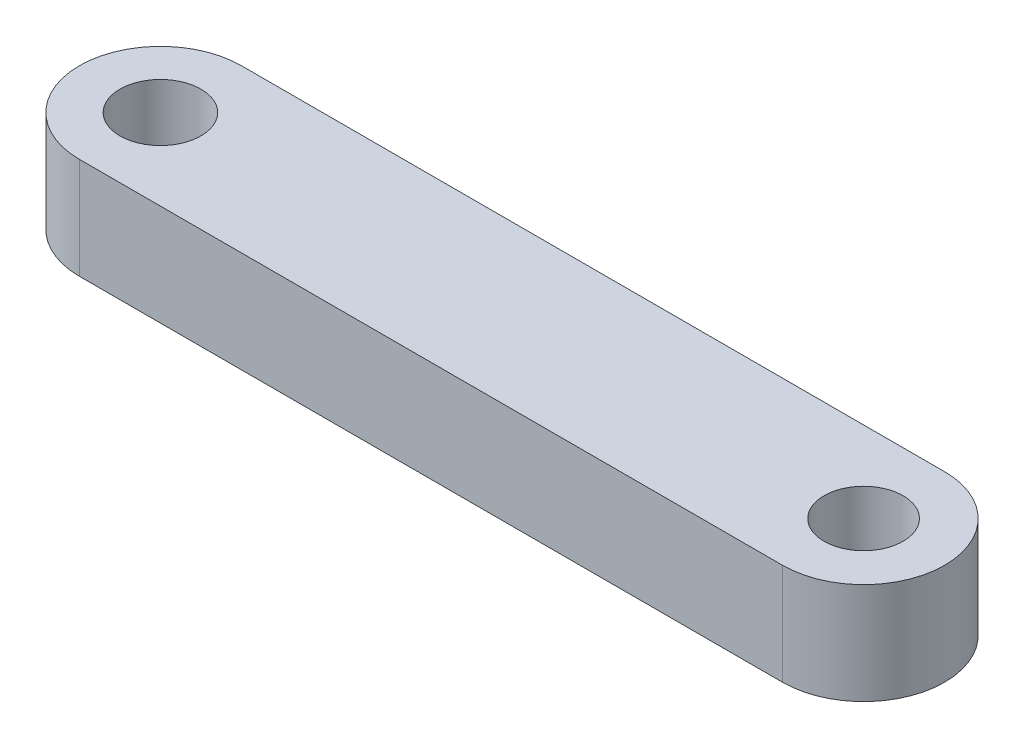
ISO-10303-21;
HEADER;
FILE_DESCRIPTION(('STEP AP214'),'2;1');
FILE_NAME('part.step','',(''),(''),'','','');
FILE_SCHEMA(('AUTOMOTIVE_DESIGN { 1 0 10303 214 1 1 1 1 }'));
ENDSEC;
DATA;
#1=APPLICATION_CONTEXT('core data for automotive mechanical design processes');
#2=APPLICATION_PROTOCOL_DEFINITION('international standard','automotive_design',2000,#1);
#3=PRODUCT_CONTEXT('',#1,'mechanical');
#4=PRODUCT('Part','Part','',(#3));
#5=PRODUCT_RELATED_PRODUCT_CATEGORY('part','',(#4));
#6=PRODUCT_DEFINITION_FORMATION('','',#4);
#7=PRODUCT_DEFINITION_CONTEXT('part definition',#1,'design');
#8=PRODUCT_DEFINITION('design','',#6,#7);
#9=PRODUCT_DEFINITION_SHAPE('','',#8);
#10=(LENGTH_UNIT() NAMED_UNIT(*) SI_UNIT(.MILLI.,.METRE.));
#11=(NAMED_UNIT(*) PLANE_ANGLE_UNIT() SI_UNIT($,.RADIAN.));
#12=(NAMED_UNIT(*) SI_UNIT($,.STERADIAN.) SOLID_ANGLE_UNIT());
#13=UNCERTAINTY_MEASURE_WITH_UNIT(LENGTH_MEASURE(1.E-05),#10,'distance_accuracy_value','');
#14=(GEOMETRIC_REPRESENTATION_CONTEXT(3) GLOBAL_UNCERTAINTY_ASSIGNED_CONTEXT((#13)) GLOBAL_UNIT_ASSIGNED_CONTEXT((#10,
#11,#12)) REPRESENTATION_CONTEXT('',''));
#15=CARTESIAN_POINT('',(0.,0.,0.));
#16=DIRECTION('',(0.,0.,1.));
#17=DIRECTION('',(1.,0.,0.));
#18=AXIS2_PLACEMENT_3D('',#15,#16,#17);
#19=CARTESIAN_POINT('',(0.,5.,0.));
#20=DIRECTION('',(0.,1.,0.));
#21=DIRECTION('',(0.,0.,1.));
#22=AXIS2_PLACEMENT_3D('',#19,#20,#21);
#23=PLANE('',#22);
#24=CARTESIAN_POINT('',(0.,5.,0.));
#25=DIRECTION('',(0.,1.,0.));
#26=DIRECTION('',(0.,0.,1.));
#27=AXIS2_PLACEMENT_3D('',#24,#25,#26);
#28=CIRCLE('',#27,2.);
#29=CARTESIAN_POINT('',(0.,5.,2.));
#30=VERTEX_POINT('',#29);
#31=EDGE_CURVE('E101',#30,#30,#28,.T.);
#32=ORIENTED_EDGE('',*,*,#31,.F.);
#33=EDGE_LOOP('',(#32));
#34=FACE_BOUND('',#33,.T.);
#35=CARTESIAN_POINT('',(0.,5.,0.));
#36=DIRECTION('',(0.,1.,0.));
#37=DIRECTION('',(0.,0.,1.));
#38=AXIS2_PLACEMENT_3D('',#35,#36,#37);
#39=CIRCLE('',#38,4.);
#40=CARTESIAN_POINT('',(0.,5.,-4.));
#41=VERTEX_POINT('',#40);
#42=CARTESIAN_POINT('',(0.,5.,4.));
#43=VERTEX_POINT('',#42);
#44=EDGE_CURVE('E86',#41,#43,#39,.T.);
#45=ORIENTED_EDGE('',*,*,#44,.T.);
#46=DIRECTION('',(1.,0.,0.));
#47=VECTOR('',#46,1.);
#48=CARTESIAN_POINT('',(0.,5.,4.));
#49=LINE('',#48,#47);
#50=CARTESIAN_POINT('',(34.702,5.,4.));
#51=VERTEX_POINT('',#50);
#52=EDGE_CURVE('E81',#43,#51,#49,.T.);
#53=ORIENTED_EDGE('',*,*,#52,.T.);
#54=CARTESIAN_POINT('',(34.702,5.,0.));
#55=DIRECTION('',(0.,1.,0.));
#56=DIRECTION('',(0.,0.,1.));
#57=AXIS2_PLACEMENT_3D('',#54,#55,#56);
#58=CIRCLE('',#57,4.);
#59=CARTESIAN_POINT('',(34.702,5.,-4.));
#60=VERTEX_POINT('',#59);
#61=EDGE_CURVE('E84',#51,#60,#58,.T.);
#62=ORIENTED_EDGE('',*,*,#61,.T.);
#63=DIRECTION('',(-1.,0.,0.));
#64=VECTOR('',#63,1.);
#65=CARTESIAN_POINT('',(0.,5.,-4.));
#66=LINE('',#65,#64);
#67=EDGE_CURVE('E51',#60,#41,#66,.T.);
#68=ORIENTED_EDGE('',*,*,#67,.T.);
#69=EDGE_LOOP('',(#45,#53,#62,#68));
#70=FACE_BOUND('',#69,.T.);
#71=CARTESIAN_POINT('',(34.702,5.,0.));
#72=DIRECTION('',(0.,1.,0.));
#73=DIRECTION('',(0.,0.,1.));
#74=AXIS2_PLACEMENT_3D('',#71,#72,#73);
#75=CIRCLE('',#74,1.95);
#76=CARTESIAN_POINT('',(34.702,5.,1.95));
#77=VERTEX_POINT('',#76);
#78=EDGE_CURVE('E116',#77,#77,#75,.T.);
#79=ORIENTED_EDGE('',*,*,#78,.F.);
#80=EDGE_LOOP('',(#79));
#81=FACE_BOUND('',#80,.T.);
#82=ADVANCED_FACE('F34',(#34,#70,#81),#23,.T.);
#83=CARTESIAN_POINT('',(0.,0.,0.));
#84=DIRECTION('',(0.,1.,0.));
#85=DIRECTION('',(0.,0.,1.));
#86=AXIS2_PLACEMENT_3D('',#83,#84,#85);
#87=PLANE('',#86);
#88=CARTESIAN_POINT('',(0.,0.,0.));
#89=DIRECTION('',(0.,1.,0.));
#90=DIRECTION('',(0.,0.,1.));
#91=AXIS2_PLACEMENT_3D('',#88,#89,#90);
#92=CIRCLE('',#91,4.);
#93=CARTESIAN_POINT('',(0.,0.,-4.));
#94=VERTEX_POINT('',#93);
#95=CARTESIAN_POINT('',(0.,0.,4.));
#96=VERTEX_POINT('',#95);
#97=EDGE_CURVE('E98',#94,#96,#92,.T.);
#98=ORIENTED_EDGE('',*,*,#97,.F.);
#99=DIRECTION('',(-1.,0.,0.));
#100=VECTOR('',#99,1.);
#101=CARTESIAN_POINT('',(0.,0.,-4.));
#102=LINE('',#101,#100);
#103=CARTESIAN_POINT('',(34.702,0.,-4.));
#104=VERTEX_POINT('',#103);
#105=EDGE_CURVE('E74',#104,#94,#102,.T.);
#106=ORIENTED_EDGE('',*,*,#105,.F.);
#107=CARTESIAN_POINT('',(34.702,0.,0.));
#108=DIRECTION('',(0.,1.,0.));
#109=DIRECTION('',(0.,0.,1.));
#110=AXIS2_PLACEMENT_3D('',#107,#108,#109);
#111=CIRCLE('',#110,4.);
#112=CARTESIAN_POINT('',(34.702,0.,4.));
#113=VERTEX_POINT('',#112);
#114=EDGE_CURVE('E68',#113,#104,#111,.T.);
#115=ORIENTED_EDGE('',*,*,#114,.F.);
#116=DIRECTION('',(1.,0.,0.));
#117=VECTOR('',#116,1.);
#118=CARTESIAN_POINT('',(0.,0.,4.));
#119=LINE('',#118,#117);
#120=EDGE_CURVE('E90',#96,#113,#119,.T.);
#121=ORIENTED_EDGE('',*,*,#120,.F.);
#122=EDGE_LOOP('',(#98,#106,#115,#121));
#123=FACE_BOUND('',#122,.T.);
#124=CARTESIAN_POINT('',(0.,0.,0.));
#125=DIRECTION('',(0.,1.,0.));
#126=DIRECTION('',(0.,0.,1.));
#127=AXIS2_PLACEMENT_3D('',#124,#125,#126);
#128=CIRCLE('',#127,2.);
#129=CARTESIAN_POINT('',(0.,0.,2.));
#130=VERTEX_POINT('',#129);
#131=EDGE_CURVE('E113',#130,#130,#128,.T.);
#132=ORIENTED_EDGE('',*,*,#131,.T.);
#133=EDGE_LOOP('',(#132));
#134=FACE_BOUND('',#133,.T.);
#135=CARTESIAN_POINT('',(34.702,0.,0.));
#136=DIRECTION('',(0.,1.,0.));
#137=DIRECTION('',(0.,0.,1.));
#138=AXIS2_PLACEMENT_3D('',#135,#136,#137);
#139=CIRCLE('',#138,1.95);
#140=CARTESIAN_POINT('',(34.702,0.,1.95));
#141=VERTEX_POINT('',#140);
#142=EDGE_CURVE('E119',#141,#141,#139,.T.);
#143=ORIENTED_EDGE('',*,*,#142,.T.);
#144=EDGE_LOOP('',(#143));
#145=FACE_BOUND('',#144,.T.);
#146=ADVANCED_FACE('F109',(#123,#134,#145),#87,.F.);
#147=CARTESIAN_POINT('',(0.,5.,0.));
#148=DIRECTION('',(0.,-1.,0.));
#149=DIRECTION('',(0.,0.,-1.));
#150=AXIS2_PLACEMENT_3D('',#147,#148,#149);
#151=CYLINDRICAL_SURFACE('',#150,4.);
#152=ORIENTED_EDGE('',*,*,#97,.T.);
#153=DIRECTION('',(0.,-1.,0.));
#154=VECTOR('',#153,1.);
#155=CARTESIAN_POINT('',(0.,5.,4.));
#156=LINE('',#155,#154);
#157=EDGE_CURVE('E11',#43,#96,#156,.T.);
#158=ORIENTED_EDGE('',*,*,#157,.F.);
#159=ORIENTED_EDGE('',*,*,#44,.F.);
#160=DIRECTION('',(0.,-1.,0.));
#161=VECTOR('',#160,1.);
#162=CARTESIAN_POINT('',(0.,5.,-4.));
#163=LINE('',#162,#161);
#164=EDGE_CURVE('E94',#41,#94,#163,.T.);
#165=ORIENTED_EDGE('',*,*,#164,.T.);
#166=EDGE_LOOP('',(#152,#158,#159,#165));
#167=FACE_BOUND('',#166,.T.);
#168=ADVANCED_FACE('F36',(#167),#151,.T.);
#169=CARTESIAN_POINT('',(0.,5.,4.));
#170=DIRECTION('',(0.,0.,-1.));
#171=DIRECTION('',(-1.,0.,0.));
#172=AXIS2_PLACEMENT_3D('',#169,#170,#171);
#173=PLANE('',#172);
#174=ORIENTED_EDGE('',*,*,#120,.T.);
#175=DIRECTION('',(0.,-1.,0.));
#176=VECTOR('',#175,1.);
#177=CARTESIAN_POINT('',(34.702,5.,4.));
#178=LINE('',#177,#176);
#179=EDGE_CURVE('E43',#51,#113,#178,.T.);
#180=ORIENTED_EDGE('',*,*,#179,.F.);
#181=ORIENTED_EDGE('',*,*,#52,.F.);
#182=ORIENTED_EDGE('',*,*,#157,.T.);
#183=EDGE_LOOP('',(#174,#180,#181,#182));
#184=FACE_BOUND('',#183,.T.);
#185=ADVANCED_FACE('F89',(#184),#173,.F.);
#186=CARTESIAN_POINT('',(34.702,5.,0.));
#187=DIRECTION('',(0.,-1.,0.));
#188=DIRECTION('',(0.,0.,-1.));
#189=AXIS2_PLACEMENT_3D('',#186,#187,#188);
#190=CYLINDRICAL_SURFACE('',#189,4.);
#191=ORIENTED_EDGE('',*,*,#114,.T.);
#192=DIRECTION('',(0.,-1.,0.));
#193=VECTOR('',#192,1.);
#194=CARTESIAN_POINT('',(34.702,5.,-4.));
#195=LINE('',#194,#193);
#196=EDGE_CURVE('E91',#60,#104,#195,.T.);
#197=ORIENTED_EDGE('',*,*,#196,.F.);
#198=ORIENTED_EDGE('',*,*,#61,.F.);
#199=ORIENTED_EDGE('',*,*,#179,.T.);
#200=EDGE_LOOP('',(#191,#197,#198,#199));
#201=FACE_BOUND('',#200,.T.);
#202=ADVANCED_FACE('F92',(#201),#190,.T.);
#203=CARTESIAN_POINT('',(0.,5.,-4.));
#204=DIRECTION('',(0.,0.,1.));
#205=DIRECTION('',(1.,0.,0.));
#206=AXIS2_PLACEMENT_3D('',#203,#204,#205);
#207=PLANE('',#206);
#208=ORIENTED_EDGE('',*,*,#105,.T.);
#209=ORIENTED_EDGE('',*,*,#164,.F.);
#210=ORIENTED_EDGE('',*,*,#67,.F.);
#211=ORIENTED_EDGE('',*,*,#196,.T.);
#212=EDGE_LOOP('',(#208,#209,#210,#211));
#213=FACE_BOUND('',#212,.T.);
#214=ADVANCED_FACE('F106',(#213),#207,.F.);
#215=CARTESIAN_POINT('',(0.,5.,0.));
#216=DIRECTION('',(0.,-1.,0.));
#217=DIRECTION('',(0.,0.,-1.));
#218=AXIS2_PLACEMENT_3D('',#215,#216,#217);
#219=CYLINDRICAL_SURFACE('',#218,2.);
#220=ORIENTED_EDGE('',*,*,#31,.T.);
#221=EDGE_LOOP('',(#220));
#222=FACE_BOUND('',#221,.T.);
#223=ORIENTED_EDGE('',*,*,#131,.F.);
#224=EDGE_LOOP('',(#223));
#225=FACE_BOUND('',#224,.T.);
#226=ADVANCED_FACE('F136',(#222,#225),#219,.F.);
#227=CARTESIAN_POINT('',(34.702,5.,0.));
#228=DIRECTION('',(0.,-1.,0.));
#229=DIRECTION('',(0.,0.,-1.));
#230=AXIS2_PLACEMENT_3D('',#227,#228,#229);
#231=CYLINDRICAL_SURFACE('',#230,1.95);
#232=ORIENTED_EDGE('',*,*,#78,.T.);
#233=EDGE_LOOP('',(#232));
#234=FACE_BOUND('',#233,.T.);
#235=ORIENTED_EDGE('',*,*,#142,.F.);
#236=EDGE_LOOP('',(#235));
#237=FACE_BOUND('',#236,.T.);
#238=ADVANCED_FACE('F125',(#234,#237),#231,.F.);
#239=CLOSED_SHELL('',(#82,#146,#168,#185,#202,#214,#226,#238));
#240=MANIFOLD_SOLID_BREP('B2',#239);
#241=ADVANCED_BREP_SHAPE_REPRESENTATION('',(#18,#240),#14);
#242=SHAPE_DEFINITION_REPRESENTATION(#9,#241);
ENDSEC;
END-ISO-10303-21;
